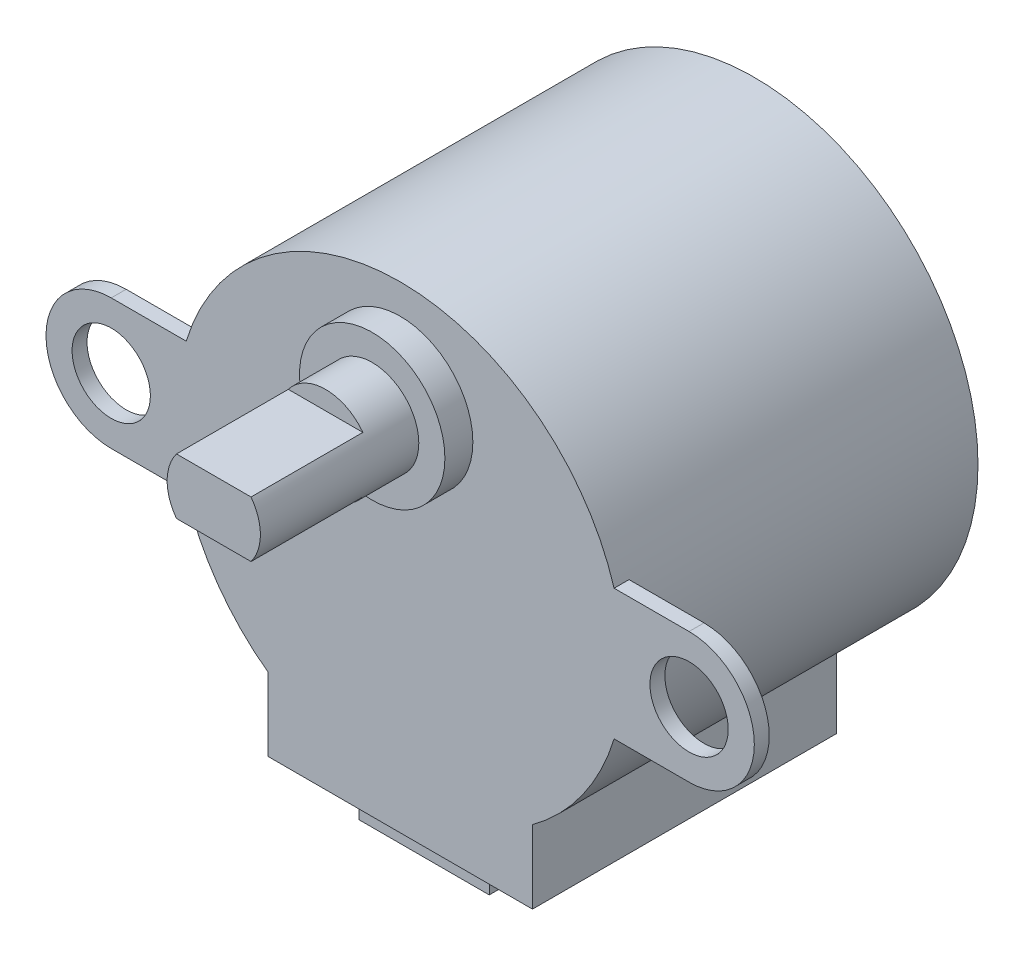
ISO-10303-21;
HEADER;
FILE_DESCRIPTION(('STEP AP214'),'2;1');
FILE_NAME('part.step','',(''),(''),'','','');
FILE_SCHEMA(('AUTOMOTIVE_DESIGN { 1 0 10303 214 1 1 1 1 }'));
ENDSEC;
DATA;
#1=APPLICATION_CONTEXT('core data for automotive mechanical design processes');
#2=APPLICATION_PROTOCOL_DEFINITION('international standard','automotive_design',2000,#1);
#3=PRODUCT_CONTEXT('',#1,'mechanical');
#4=PRODUCT('Part','Part','',(#3));
#5=PRODUCT_RELATED_PRODUCT_CATEGORY('part','',(#4));
#6=PRODUCT_DEFINITION_FORMATION('','',#4);
#7=PRODUCT_DEFINITION_CONTEXT('part definition',#1,'design');
#8=PRODUCT_DEFINITION('design','',#6,#7);
#9=PRODUCT_DEFINITION_SHAPE('','',#8);
#10=(LENGTH_UNIT() NAMED_UNIT(*) SI_UNIT(.MILLI.,.METRE.));
#11=(NAMED_UNIT(*) PLANE_ANGLE_UNIT() SI_UNIT($,.RADIAN.));
#12=(NAMED_UNIT(*) SI_UNIT($,.STERADIAN.) SOLID_ANGLE_UNIT());
#13=UNCERTAINTY_MEASURE_WITH_UNIT(LENGTH_MEASURE(1.E-05),#10,'distance_accuracy_value','');
#14=(GEOMETRIC_REPRESENTATION_CONTEXT(3) GLOBAL_UNCERTAINTY_ASSIGNED_CONTEXT((#13)) GLOBAL_UNIT_ASSIGNED_CONTEXT((#10,
#11,#12)) REPRESENTATION_CONTEXT('',''));
#15=CARTESIAN_POINT('',(0.,0.,0.));
#16=DIRECTION('',(0.,0.,1.));
#17=DIRECTION('',(1.,0.,0.));
#18=AXIS2_PLACEMENT_3D('',#15,#16,#17);
#19=CARTESIAN_POINT('',(0.,-13.6,0.));
#20=DIRECTION('',(0.,-1.,0.));
#21=DIRECTION('',(0.,0.,-1.));
#22=AXIS2_PLACEMENT_3D('',#19,#20,#21);
#23=PLANE('',#22);
#24=DIRECTION('',(0.,0.,1.));
#25=VECTOR('',#24,1.);
#26=CARTESIAN_POINT('',(-7.1,-13.6,19.));
#27=LINE('',#26,#25);
#28=CARTESIAN_POINT('',(-7.1,-13.6,2.7));
#29=VERTEX_POINT('',#28);
#30=CARTESIAN_POINT('',(-7.1,-13.6,19.));
#31=VERTEX_POINT('',#30);
#32=EDGE_CURVE('E197',#29,#31,#27,.T.);
#33=ORIENTED_EDGE('',*,*,#32,.F.);
#34=DIRECTION('',(-1.,0.,0.));
#35=VECTOR('',#34,1.);
#36=CARTESIAN_POINT('',(-7.1,-13.6,2.7));
#37=LINE('',#36,#35);
#38=CARTESIAN_POINT('',(7.1,-13.6,2.7));
#39=VERTEX_POINT('',#38);
#40=EDGE_CURVE('E209',#39,#29,#37,.T.);
#41=ORIENTED_EDGE('',*,*,#40,.F.);
#42=DIRECTION('',(0.,0.,-1.));
#43=VECTOR('',#42,1.);
#44=CARTESIAN_POINT('',(7.1,-13.6,19.));
#45=LINE('',#44,#43);
#46=CARTESIAN_POINT('',(7.1,-13.6,19.));
#47=VERTEX_POINT('',#46);
#48=EDGE_CURVE('E206',#47,#39,#45,.T.);
#49=ORIENTED_EDGE('',*,*,#48,.F.);
#50=DIRECTION('',(1.,0.,0.));
#51=VECTOR('',#50,1.);
#52=CARTESIAN_POINT('',(-7.1,-13.6,19.));
#53=LINE('',#52,#51);
#54=EDGE_CURVE('E200',#31,#47,#53,.T.);
#55=ORIENTED_EDGE('',*,*,#54,.F.);
#56=EDGE_LOOP('',(#33,#41,#49,#55));
#57=FACE_BOUND('',#56,.T.);
#58=DIRECTION('',(-1.,0.,0.));
#59=VECTOR('',#58,1.);
#60=CARTESIAN_POINT('',(-3.71951204175312,-13.6,17.5));
#61=LINE('',#60,#59);
#62=CARTESIAN_POINT('',(3.28048795824688,-13.6,17.5));
#63=VERTEX_POINT('',#62);
#64=CARTESIAN_POINT('',(-3.71951204175312,-13.6,17.5));
#65=VERTEX_POINT('',#64);
#66=EDGE_CURVE('E626',#63,#65,#61,.T.);
#67=ORIENTED_EDGE('',*,*,#66,.F.);
#68=DIRECTION('',(0.,0.,1.));
#69=VECTOR('',#68,1.);
#70=CARTESIAN_POINT('',(3.28048795824688,-13.6,16.5));
#71=LINE('',#70,#69);
#72=CARTESIAN_POINT('',(3.28048795824688,-13.6,16.5));
#73=VERTEX_POINT('',#72);
#74=EDGE_CURVE('E195',#73,#63,#71,.T.);
#75=ORIENTED_EDGE('',*,*,#74,.F.);
#76=DIRECTION('',(1.,0.,0.));
#77=VECTOR('',#76,1.);
#78=CARTESIAN_POINT('',(-3.71951204175312,-13.6,16.5));
#79=LINE('',#78,#77);
#80=CARTESIAN_POINT('',(-3.71951204175312,-13.6,16.5));
#81=VERTEX_POINT('',#80);
#82=EDGE_CURVE('E191',#81,#73,#79,.T.);
#83=ORIENTED_EDGE('',*,*,#82,.F.);
#84=DIRECTION('',(0.,0.,-1.));
#85=VECTOR('',#84,1.);
#86=CARTESIAN_POINT('',(-3.71951204175312,-13.6,16.5));
#87=LINE('',#86,#85);
#88=EDGE_CURVE('E623',#65,#81,#87,.T.);
#89=ORIENTED_EDGE('',*,*,#88,.F.);
#90=EDGE_LOOP('',(#67,#75,#83,#89));
#91=FACE_BOUND('',#90,.T.);
#92=ADVANCED_FACE('F35',(#57,#91),#23,.T.);
#93=CARTESIAN_POINT('',(0.,6.5,29.));
#94=DIRECTION('',(0.,0.,-1.));
#95=DIRECTION('',(-1.,0.,0.));
#96=AXIS2_PLACEMENT_3D('',#93,#94,#95);
#97=CYLINDRICAL_SURFACE('',#96,2.5);
#98=CARTESIAN_POINT('',(0.,6.5,20.5));
#99=DIRECTION('',(0.,0.,1.));
#100=DIRECTION('',(1.,0.,0.));
#101=AXIS2_PLACEMENT_3D('',#98,#99,#100);
#102=CIRCLE('',#101,2.5);
#103=CARTESIAN_POINT('',(2.5,6.5,20.5));
#104=VERTEX_POINT('',#103);
#105=EDGE_CURVE('E43',#104,#104,#102,.T.);
#106=ORIENTED_EDGE('',*,*,#105,.T.);
#107=EDGE_LOOP('',(#106));
#108=FACE_BOUND('',#107,.T.);
#109=DIRECTION('',(0.,0.,1.));
#110=VECTOR('',#109,1.);
#111=CARTESIAN_POINT('',(2.,8.,23.));
#112=LINE('',#111,#110);
#113=CARTESIAN_POINT('',(2.,8.,23.));
#114=VERTEX_POINT('',#113);
#115=CARTESIAN_POINT('',(2.,8.,29.));
#116=VERTEX_POINT('',#115);
#117=EDGE_CURVE('E238',#114,#116,#112,.T.);
#118=ORIENTED_EDGE('',*,*,#117,.T.);
#119=CARTESIAN_POINT('',(0.,6.5,29.));
#120=DIRECTION('',(0.,0.,1.));
#121=DIRECTION('',(1.,0.,0.));
#122=AXIS2_PLACEMENT_3D('',#119,#120,#121);
#123=CIRCLE('',#122,2.5);
#124=CARTESIAN_POINT('',(2.,5.,29.));
#125=VERTEX_POINT('',#124);
#126=EDGE_CURVE('E241',#125,#116,#123,.T.);
#127=ORIENTED_EDGE('',*,*,#126,.F.);
#128=DIRECTION('',(0.,0.,1.));
#129=VECTOR('',#128,1.);
#130=CARTESIAN_POINT('',(2.,5.,23.));
#131=LINE('',#130,#129);
#132=CARTESIAN_POINT('',(2.,5.,23.));
#133=VERTEX_POINT('',#132);
#134=EDGE_CURVE('E248',#133,#125,#131,.T.);
#135=ORIENTED_EDGE('',*,*,#134,.F.);
#136=CARTESIAN_POINT('',(0.,6.5,23.));
#137=DIRECTION('',(0.,0.,1.));
#138=DIRECTION('',(1.,0.,0.));
#139=AXIS2_PLACEMENT_3D('',#136,#137,#138);
#140=CIRCLE('',#139,2.5);
#141=CARTESIAN_POINT('',(-2.,5.,23.));
#142=VERTEX_POINT('',#141);
#143=EDGE_CURVE('E243',#142,#133,#140,.T.);
#144=ORIENTED_EDGE('',*,*,#143,.F.);
#145=DIRECTION('',(0.,0.,1.));
#146=VECTOR('',#145,1.);
#147=CARTESIAN_POINT('',(-2.,5.,23.));
#148=LINE('',#147,#146);
#149=CARTESIAN_POINT('',(-2.,5.,29.));
#150=VERTEX_POINT('',#149);
#151=EDGE_CURVE('E237',#142,#150,#148,.T.);
#152=ORIENTED_EDGE('',*,*,#151,.T.);
#153=CARTESIAN_POINT('',(-2.,8.,29.));
#154=VERTEX_POINT('',#153);
#155=EDGE_CURVE('E256',#154,#150,#123,.T.);
#156=ORIENTED_EDGE('',*,*,#155,.F.);
#157=DIRECTION('',(0.,0.,1.));
#158=VECTOR('',#157,1.);
#159=CARTESIAN_POINT('',(-2.,8.,23.));
#160=LINE('',#159,#158);
#161=CARTESIAN_POINT('',(-2.,8.,23.));
#162=VERTEX_POINT('',#161);
#163=EDGE_CURVE('E234',#162,#154,#160,.T.);
#164=ORIENTED_EDGE('',*,*,#163,.F.);
#165=CARTESIAN_POINT('',(0.,6.5,23.));
#166=DIRECTION('',(0.,0.,1.));
#167=DIRECTION('',(1.,0.,0.));
#168=AXIS2_PLACEMENT_3D('',#165,#166,#167);
#169=CIRCLE('',#168,2.5);
#170=EDGE_CURVE('E228',#114,#162,#169,.T.);
#171=ORIENTED_EDGE('',*,*,#170,.F.);
#172=EDGE_LOOP('',(#118,#127,#135,#144,#152,#156,#164,#171));
#173=FACE_BOUND('',#172,.T.);
#174=ADVANCED_FACE('F388',(#108,#173),#97,.T.);
#175=CARTESIAN_POINT('',(0.,0.,29.));
#176=DIRECTION('',(0.,0.,1.));
#177=DIRECTION('',(1.,0.,0.));
#178=AXIS2_PLACEMENT_3D('',#175,#176,#177);
#179=PLANE('',#178);
#180=ORIENTED_EDGE('',*,*,#126,.T.);
#181=DIRECTION('',(-1.,0.,0.));
#182=VECTOR('',#181,1.);
#183=CARTESIAN_POINT('',(0.,8.,29.));
#184=LINE('',#183,#182);
#185=EDGE_CURVE('E232',#116,#154,#184,.T.);
#186=ORIENTED_EDGE('',*,*,#185,.T.);
#187=ORIENTED_EDGE('',*,*,#155,.T.);
#188=DIRECTION('',(1.,0.,0.));
#189=VECTOR('',#188,1.);
#190=CARTESIAN_POINT('',(0.,5.,29.));
#191=LINE('',#190,#189);
#192=EDGE_CURVE('E227',#150,#125,#191,.T.);
#193=ORIENTED_EDGE('',*,*,#192,.T.);
#194=EDGE_LOOP('',(#180,#186,#187,#193));
#195=FACE_BOUND('',#194,.T.);
#196=ADVANCED_FACE('F394',(#195),#179,.T.);
#197=CARTESIAN_POINT('',(0.,0.,19.));
#198=DIRECTION('',(0.,0.,-1.));
#199=DIRECTION('',(-1.,0.,0.));
#200=AXIS2_PLACEMENT_3D('',#197,#198,#199);
#201=CYLINDRICAL_SURFACE('',#200,12.);
#202=CARTESIAN_POINT('',(0.,0.,2.7));
#203=DIRECTION('',(0.,0.,-1.));
#204=DIRECTION('',(-1.,0.,0.));
#205=AXIS2_PLACEMENT_3D('',#202,#203,#204);
#206=CIRCLE('',#205,12.);
#207=CARTESIAN_POINT('',(7.1,-9.67419247275968,2.7));
#208=VERTEX_POINT('',#207);
#209=CARTESIAN_POINT('',(-7.1,-9.67419247275968,2.7));
#210=VERTEX_POINT('',#209);
#211=EDGE_CURVE('E11',#208,#210,#206,.T.);
#212=ORIENTED_EDGE('',*,*,#211,.T.);
#213=DIRECTION('',(0.,0.,-1.));
#214=VECTOR('',#213,1.);
#215=CARTESIAN_POINT('',(-7.1,-9.67419247275968,19.));
#216=LINE('',#215,#214);
#217=CARTESIAN_POINT('',(-7.1,-9.67419247275968,19.));
#218=VERTEX_POINT('',#217);
#219=EDGE_CURVE('E224',#210,#218,#216,.F.);
#220=ORIENTED_EDGE('',*,*,#219,.T.);
#221=CARTESIAN_POINT('',(0.,0.,19.));
#222=DIRECTION('',(0.,0.,1.));
#223=DIRECTION('',(1.,0.,0.));
#224=AXIS2_PLACEMENT_3D('',#221,#222,#223);
#225=CIRCLE('',#224,12.);
#226=CARTESIAN_POINT('',(-11.478240283249,-3.5,19.));
#227=VERTEX_POINT('',#226);
#228=EDGE_CURVE('E331',#227,#218,#225,.T.);
#229=ORIENTED_EDGE('',*,*,#228,.F.);
#230=DIRECTION('',(0.,0.,-1.));
#231=VECTOR('',#230,1.);
#232=CARTESIAN_POINT('',(-11.478240283249,-3.5,19.));
#233=LINE('',#232,#231);
#234=CARTESIAN_POINT('',(-11.478240283249,-3.5,18.2));
#235=VERTEX_POINT('',#234);
#236=EDGE_CURVE('E311',#227,#235,#233,.T.);
#237=ORIENTED_EDGE('',*,*,#236,.T.);
#238=CARTESIAN_POINT('',(0.,0.,18.2));
#239=DIRECTION('',(0.,0.,1.));
#240=DIRECTION('',(1.,0.,0.));
#241=AXIS2_PLACEMENT_3D('',#238,#239,#240);
#242=CIRCLE('',#241,12.);
#243=CARTESIAN_POINT('',(-11.478240283249,3.5,18.2));
#244=VERTEX_POINT('',#243);
#245=EDGE_CURVE('E259',#244,#235,#242,.T.);
#246=ORIENTED_EDGE('',*,*,#245,.F.);
#247=DIRECTION('',(0.,0.,-1.));
#248=VECTOR('',#247,1.);
#249=CARTESIAN_POINT('',(-11.478240283249,3.5,19.));
#250=LINE('',#249,#248);
#251=CARTESIAN_POINT('',(-11.478240283249,3.5,19.));
#252=VERTEX_POINT('',#251);
#253=EDGE_CURVE('E314',#244,#252,#250,.F.);
#254=ORIENTED_EDGE('',*,*,#253,.T.);
#255=CARTESIAN_POINT('',(11.478240283249,3.50000000000001,19.));
#256=VERTEX_POINT('',#255);
#257=EDGE_CURVE('E327',#256,#252,#225,.T.);
#258=ORIENTED_EDGE('',*,*,#257,.F.);
#259=DIRECTION('',(0.,0.,-1.));
#260=VECTOR('',#259,1.);
#261=CARTESIAN_POINT('',(11.478240283249,3.50000000000001,19.));
#262=LINE('',#261,#260);
#263=CARTESIAN_POINT('',(11.478240283249,3.50000000000001,18.2));
#264=VERTEX_POINT('',#263);
#265=EDGE_CURVE('E317',#256,#264,#262,.T.);
#266=ORIENTED_EDGE('',*,*,#265,.T.);
#267=CARTESIAN_POINT('',(11.478240283249,-3.49999999999999,18.2));
#268=VERTEX_POINT('',#267);
#269=EDGE_CURVE('E330',#268,#264,#242,.T.);
#270=ORIENTED_EDGE('',*,*,#269,.F.);
#271=DIRECTION('',(0.,0.,-1.));
#272=VECTOR('',#271,1.);
#273=CARTESIAN_POINT('',(11.478240283249,-3.49999999999999,19.));
#274=LINE('',#273,#272);
#275=CARTESIAN_POINT('',(11.478240283249,-3.5,19.));
#276=VERTEX_POINT('',#275);
#277=EDGE_CURVE('E302',#268,#276,#274,.F.);
#278=ORIENTED_EDGE('',*,*,#277,.T.);
#279=CARTESIAN_POINT('',(7.1,-9.67419247275968,19.));
#280=VERTEX_POINT('',#279);
#281=EDGE_CURVE('E332',#280,#276,#225,.T.);
#282=ORIENTED_EDGE('',*,*,#281,.F.);
#283=DIRECTION('',(0.,0.,-1.));
#284=VECTOR('',#283,1.);
#285=CARTESIAN_POINT('',(7.1,-9.67419247275968,19.));
#286=LINE('',#285,#284);
#287=EDGE_CURVE('E216',#280,#208,#286,.T.);
#288=ORIENTED_EDGE('',*,*,#287,.T.);
#289=EDGE_LOOP('',(#212,#220,#229,#237,#246,#254,#258,#266,#270,#278,#282,#288));
#290=FACE_BOUND('',#289,.T.);
#291=CARTESIAN_POINT('',(0.,0.,0.));
#292=DIRECTION('',(0.,0.,1.));
#293=DIRECTION('',(1.,0.,0.));
#294=AXIS2_PLACEMENT_3D('',#291,#292,#293);
#295=CIRCLE('',#294,12.);
#296=CARTESIAN_POINT('',(12.,0.,0.));
#297=VERTEX_POINT('',#296);
#298=EDGE_CURVE('E324',#297,#297,#295,.T.);
#299=ORIENTED_EDGE('',*,*,#298,.T.);
#300=EDGE_LOOP('',(#299));
#301=FACE_BOUND('',#300,.T.);
#302=ADVANCED_FACE('F37',(#290,#301),#201,.T.);
#303=CARTESIAN_POINT('',(0.,0.,19.));
#304=DIRECTION('',(0.,0.,1.));
#305=DIRECTION('',(1.,0.,0.));
#306=AXIS2_PLACEMENT_3D('',#303,#304,#305);
#307=PLANE('',#306);
#308=ORIENTED_EDGE('',*,*,#228,.T.);
#309=DIRECTION('',(0.,1.,0.));
#310=VECTOR('',#309,1.);
#311=CARTESIAN_POINT('',(-7.1,-13.6,19.));
#312=LINE('',#311,#310);
#313=EDGE_CURVE('E212',#31,#218,#312,.T.);
#314=ORIENTED_EDGE('',*,*,#313,.F.);
#315=ORIENTED_EDGE('',*,*,#54,.T.);
#316=DIRECTION('',(0.,1.,0.));
#317=VECTOR('',#316,1.);
#318=CARTESIAN_POINT('',(7.1,-13.6,19.));
#319=LINE('',#318,#317);
#320=EDGE_CURVE('E58',#47,#280,#319,.T.);
#321=ORIENTED_EDGE('',*,*,#320,.T.);
#322=ORIENTED_EDGE('',*,*,#281,.T.);
#323=DIRECTION('',(1.,0.,0.));
#324=VECTOR('',#323,1.);
#325=CARTESIAN_POINT('',(-15.5,-3.5,19.));
#326=LINE('',#325,#324);
#327=CARTESIAN_POINT('',(15.5,-3.49999999999999,19.));
#328=VERTEX_POINT('',#327);
#329=EDGE_CURVE('E291',#276,#328,#326,.T.);
#330=ORIENTED_EDGE('',*,*,#329,.T.);
#331=CARTESIAN_POINT('',(15.5,0.,19.));
#332=DIRECTION('',(0.,0.,1.));
#333=DIRECTION('',(1.,0.,0.));
#334=AXIS2_PLACEMENT_3D('',#331,#332,#333);
#335=CIRCLE('',#334,3.5);
#336=CARTESIAN_POINT('',(15.5,3.50000000000001,19.));
#337=VERTEX_POINT('',#336);
#338=EDGE_CURVE('E294',#328,#337,#335,.T.);
#339=ORIENTED_EDGE('',*,*,#338,.T.);
#340=DIRECTION('',(-1.,0.,0.));
#341=VECTOR('',#340,1.);
#342=CARTESIAN_POINT('',(-15.5,3.5,19.));
#343=LINE('',#342,#341);
#344=EDGE_CURVE('E277',#337,#256,#343,.T.);
#345=ORIENTED_EDGE('',*,*,#344,.T.);
#346=ORIENTED_EDGE('',*,*,#257,.T.);
#347=CARTESIAN_POINT('',(-15.5,3.5,19.));
#348=VERTEX_POINT('',#347);
#349=EDGE_CURVE('E297',#252,#348,#343,.T.);
#350=ORIENTED_EDGE('',*,*,#349,.T.);
#351=CARTESIAN_POINT('',(-15.5,0.,19.));
#352=DIRECTION('',(0.,0.,1.));
#353=DIRECTION('',(1.,0.,0.));
#354=AXIS2_PLACEMENT_3D('',#351,#352,#353);
#355=CIRCLE('',#354,3.5);
#356=CARTESIAN_POINT('',(-15.5,-3.5,19.));
#357=VERTEX_POINT('',#356);
#358=EDGE_CURVE('E270',#348,#357,#355,.T.);
#359=ORIENTED_EDGE('',*,*,#358,.T.);
#360=EDGE_CURVE('E292',#357,#227,#326,.T.);
#361=ORIENTED_EDGE('',*,*,#360,.T.);
#362=EDGE_LOOP('',(#308,#314,#315,#321,#322,#330,#339,#345,#346,#350,#359,#361));
#363=FACE_BOUND('',#362,.T.);
#364=CARTESIAN_POINT('',(0.,6.5,19.));
#365=DIRECTION('',(0.,0.,1.));
#366=DIRECTION('',(1.,0.,0.));
#367=AXIS2_PLACEMENT_3D('',#364,#365,#366);
#368=CIRCLE('',#367,3.9);
#369=CARTESIAN_POINT('',(3.9,6.5,19.));
#370=VERTEX_POINT('',#369);
#371=EDGE_CURVE('E320',#370,#370,#368,.T.);
#372=ORIENTED_EDGE('',*,*,#371,.F.);
#373=EDGE_LOOP('',(#372));
#374=FACE_BOUND('',#373,.T.);
#375=CARTESIAN_POINT('',(15.5,0.,19.));
#376=DIRECTION('',(0.,0.,1.));
#377=DIRECTION('',(1.,0.,0.));
#378=AXIS2_PLACEMENT_3D('',#375,#376,#377);
#379=CIRCLE('',#378,2.1);
#380=CARTESIAN_POINT('',(17.6,0.,19.));
#381=VERTEX_POINT('',#380);
#382=EDGE_CURVE('E264',#381,#381,#379,.T.);
#383=ORIENTED_EDGE('',*,*,#382,.F.);
#384=EDGE_LOOP('',(#383));
#385=FACE_BOUND('',#384,.T.);
#386=CARTESIAN_POINT('',(-15.5,0.,19.));
#387=DIRECTION('',(0.,0.,1.));
#388=DIRECTION('',(1.,0.,0.));
#389=AXIS2_PLACEMENT_3D('',#386,#387,#388);
#390=CIRCLE('',#389,2.1);
#391=CARTESIAN_POINT('',(-13.4,0.,19.));
#392=VERTEX_POINT('',#391);
#393=EDGE_CURVE('E263',#392,#392,#390,.T.);
#394=ORIENTED_EDGE('',*,*,#393,.F.);
#395=EDGE_LOOP('',(#394));
#396=FACE_BOUND('',#395,.T.);
#397=ADVANCED_FACE('F354',(#363,#374,#385,#396),#307,.T.);
#398=CARTESIAN_POINT('',(0.,0.,0.));
#399=DIRECTION('',(0.,0.,1.));
#400=DIRECTION('',(1.,0.,0.));
#401=AXIS2_PLACEMENT_3D('',#398,#399,#400);
#402=PLANE('',#401);
#403=ORIENTED_EDGE('',*,*,#298,.F.);
#404=EDGE_LOOP('',(#403));
#405=FACE_BOUND('',#404,.T.);
#406=ADVANCED_FACE('F552',(#405),#402,.F.);
#407=CARTESIAN_POINT('',(0.,6.5,20.5));
#408=DIRECTION('',(0.,0.,-1.));
#409=DIRECTION('',(-1.,0.,0.));
#410=AXIS2_PLACEMENT_3D('',#407,#408,#409);
#411=CYLINDRICAL_SURFACE('',#410,3.9);
#412=CARTESIAN_POINT('',(0.,6.5,20.5));
#413=DIRECTION('',(0.,0.,1.));
#414=DIRECTION('',(1.,0.,0.));
#415=AXIS2_PLACEMENT_3D('',#412,#413,#414);
#416=CIRCLE('',#415,3.9);
#417=CARTESIAN_POINT('',(3.9,6.5,20.5));
#418=VERTEX_POINT('',#417);
#419=EDGE_CURVE('E321',#418,#418,#416,.T.);
#420=ORIENTED_EDGE('',*,*,#419,.F.);
#421=EDGE_LOOP('',(#420));
#422=FACE_BOUND('',#421,.T.);
#423=ORIENTED_EDGE('',*,*,#371,.T.);
#424=EDGE_LOOP('',(#423));
#425=FACE_BOUND('',#424,.T.);
#426=ADVANCED_FACE('F495',(#422,#425),#411,.T.);
#427=CARTESIAN_POINT('',(0.,6.5,20.5));
#428=DIRECTION('',(0.,0.,1.));
#429=DIRECTION('',(1.,0.,0.));
#430=AXIS2_PLACEMENT_3D('',#427,#428,#429);
#431=PLANE('',#430);
#432=ORIENTED_EDGE('',*,*,#105,.F.);
#433=EDGE_LOOP('',(#432));
#434=FACE_BOUND('',#433,.T.);
#435=ORIENTED_EDGE('',*,*,#419,.T.);
#436=EDGE_LOOP('',(#435));
#437=FACE_BOUND('',#436,.T.);
#438=ADVANCED_FACE('F434',(#434,#437),#431,.T.);
#439=CARTESIAN_POINT('',(15.5,0.,18.2));
#440=DIRECTION('',(0.,0.,1.));
#441=DIRECTION('',(1.,0.,0.));
#442=AXIS2_PLACEMENT_3D('',#439,#440,#441);
#443=CYLINDRICAL_SURFACE('',#442,2.1);
#444=CARTESIAN_POINT('',(15.5,0.,18.2));
#445=DIRECTION('',(0.,0.,1.));
#446=DIRECTION('',(1.,0.,0.));
#447=AXIS2_PLACEMENT_3D('',#444,#445,#446);
#448=CIRCLE('',#447,2.1);
#449=CARTESIAN_POINT('',(17.6,0.,18.2));
#450=VERTEX_POINT('',#449);
#451=EDGE_CURVE('E260',#450,#450,#448,.T.);
#452=ORIENTED_EDGE('',*,*,#451,.F.);
#453=EDGE_LOOP('',(#452));
#454=FACE_BOUND('',#453,.T.);
#455=ORIENTED_EDGE('',*,*,#382,.T.);
#456=EDGE_LOOP('',(#455));
#457=FACE_BOUND('',#456,.T.);
#458=ADVANCED_FACE('F432',(#454,#457),#443,.F.);
#459=CARTESIAN_POINT('',(15.5,0.,18.2));
#460=DIRECTION('',(0.,0.,1.));
#461=DIRECTION('',(1.,0.,0.));
#462=AXIS2_PLACEMENT_3D('',#459,#460,#461);
#463=CYLINDRICAL_SURFACE('',#462,3.5);
#464=ORIENTED_EDGE('',*,*,#338,.F.);
#465=DIRECTION('',(0.,0.,1.));
#466=VECTOR('',#465,1.);
#467=CARTESIAN_POINT('',(15.5,-3.49999999999999,18.2));
#468=LINE('',#467,#466);
#469=CARTESIAN_POINT('',(15.5,-3.49999999999999,18.2));
#470=VERTEX_POINT('',#469);
#471=EDGE_CURVE('E305',#470,#328,#468,.T.);
#472=ORIENTED_EDGE('',*,*,#471,.F.);
#473=CARTESIAN_POINT('',(15.5,0.,18.2));
#474=DIRECTION('',(0.,0.,1.));
#475=DIRECTION('',(1.,0.,0.));
#476=AXIS2_PLACEMENT_3D('',#473,#474,#475);
#477=CIRCLE('',#476,3.5);
#478=CARTESIAN_POINT('',(15.5,3.50000000000001,18.2));
#479=VERTEX_POINT('',#478);
#480=EDGE_CURVE('E281',#470,#479,#477,.T.);
#481=ORIENTED_EDGE('',*,*,#480,.T.);
#482=DIRECTION('',(0.,0.,1.));
#483=VECTOR('',#482,1.);
#484=CARTESIAN_POINT('',(15.5,3.50000000000001,18.2));
#485=LINE('',#484,#483);
#486=EDGE_CURVE('E303',#479,#337,#485,.T.);
#487=ORIENTED_EDGE('',*,*,#486,.T.);
#488=EDGE_LOOP('',(#464,#472,#481,#487));
#489=FACE_BOUND('',#488,.T.);
#490=ADVANCED_FACE('F368',(#489),#463,.T.);
#491=CARTESIAN_POINT('',(-15.5,0.,18.2));
#492=DIRECTION('',(0.,0.,1.));
#493=DIRECTION('',(1.,0.,0.));
#494=AXIS2_PLACEMENT_3D('',#491,#492,#493);
#495=PLANE('',#494);
#496=ORIENTED_EDGE('',*,*,#451,.T.);
#497=EDGE_LOOP('',(#496));
#498=FACE_BOUND('',#497,.T.);
#499=DIRECTION('',(1.,0.,0.));
#500=VECTOR('',#499,1.);
#501=CARTESIAN_POINT('',(-15.5,-3.5,18.2));
#502=LINE('',#501,#500);
#503=EDGE_CURVE('E276',#268,#470,#502,.T.);
#504=ORIENTED_EDGE('',*,*,#503,.F.);
#505=ORIENTED_EDGE('',*,*,#269,.T.);
#506=DIRECTION('',(-1.,0.,0.));
#507=VECTOR('',#506,1.);
#508=CARTESIAN_POINT('',(-15.5,3.5,18.2));
#509=LINE('',#508,#507);
#510=EDGE_CURVE('E285',#479,#264,#509,.T.);
#511=ORIENTED_EDGE('',*,*,#510,.F.);
#512=ORIENTED_EDGE('',*,*,#480,.F.);
#513=EDGE_LOOP('',(#504,#505,#511,#512));
#514=FACE_BOUND('',#513,.T.);
#515=ADVANCED_FACE('F366',(#498,#514),#495,.F.);
#516=CARTESIAN_POINT('',(-15.5,-3.5,18.2));
#517=DIRECTION('',(0.,-1.,0.));
#518=DIRECTION('',(1.,0.,0.));
#519=AXIS2_PLACEMENT_3D('',#516,#517,#518);
#520=PLANE('',#519);
#521=ORIENTED_EDGE('',*,*,#277,.F.);
#522=ORIENTED_EDGE('',*,*,#503,.T.);
#523=ORIENTED_EDGE('',*,*,#471,.T.);
#524=ORIENTED_EDGE('',*,*,#329,.F.);
#525=EDGE_LOOP('',(#521,#522,#523,#524));
#526=FACE_BOUND('',#525,.T.);
#527=ADVANCED_FACE('F357',(#526),#520,.T.);
#528=CARTESIAN_POINT('',(-15.5,3.5,18.2));
#529=DIRECTION('',(0.,1.,0.));
#530=DIRECTION('',(-1.,0.,0.));
#531=AXIS2_PLACEMENT_3D('',#528,#529,#530);
#532=PLANE('',#531);
#533=ORIENTED_EDGE('',*,*,#265,.F.);
#534=ORIENTED_EDGE('',*,*,#344,.F.);
#535=ORIENTED_EDGE('',*,*,#486,.F.);
#536=ORIENTED_EDGE('',*,*,#510,.T.);
#537=EDGE_LOOP('',(#533,#534,#535,#536));
#538=FACE_BOUND('',#537,.T.);
#539=ADVANCED_FACE('F364',(#538),#532,.T.);
#540=CARTESIAN_POINT('',(-15.5,0.,18.2));
#541=DIRECTION('',(0.,0.,1.));
#542=DIRECTION('',(1.,0.,0.));
#543=AXIS2_PLACEMENT_3D('',#540,#541,#542);
#544=CIRCLE('',#543,2.1);
#545=CARTESIAN_POINT('',(-13.4,0.,18.2));
#546=VERTEX_POINT('',#545);
#547=EDGE_CURVE('E267',#546,#546,#544,.T.);
#548=ORIENTED_EDGE('',*,*,#547,.T.);
#549=EDGE_LOOP('',(#548));
#550=FACE_BOUND('',#549,.T.);
#551=CARTESIAN_POINT('',(-15.5,3.5,18.2));
#552=VERTEX_POINT('',#551);
#553=EDGE_CURVE('E284',#244,#552,#509,.T.);
#554=ORIENTED_EDGE('',*,*,#553,.F.);
#555=ORIENTED_EDGE('',*,*,#245,.T.);
#556=CARTESIAN_POINT('',(-15.5,-3.5,18.2));
#557=VERTEX_POINT('',#556);
#558=EDGE_CURVE('E278',#557,#235,#502,.T.);
#559=ORIENTED_EDGE('',*,*,#558,.F.);
#560=CARTESIAN_POINT('',(-15.5,0.,18.2));
#561=DIRECTION('',(0.,0.,1.));
#562=DIRECTION('',(1.,0.,0.));
#563=AXIS2_PLACEMENT_3D('',#560,#561,#562);
#564=CIRCLE('',#563,3.5);
#565=EDGE_CURVE('E273',#552,#557,#564,.T.);
#566=ORIENTED_EDGE('',*,*,#565,.F.);
#567=EDGE_LOOP('',(#554,#555,#559,#566));
#568=FACE_BOUND('',#567,.T.);
#569=ADVANCED_FACE('F342',(#550,#568),#495,.F.);
#570=ORIENTED_EDGE('',*,*,#253,.F.);
#571=ORIENTED_EDGE('',*,*,#553,.T.);
#572=DIRECTION('',(0.,0.,1.));
#573=VECTOR('',#572,1.);
#574=CARTESIAN_POINT('',(-15.5,3.5,18.2));
#575=LINE('',#574,#573);
#576=EDGE_CURVE('E299',#552,#348,#575,.T.);
#577=ORIENTED_EDGE('',*,*,#576,.T.);
#578=ORIENTED_EDGE('',*,*,#349,.F.);
#579=EDGE_LOOP('',(#570,#571,#577,#578));
#580=FACE_BOUND('',#579,.T.);
#581=ADVANCED_FACE('F372',(#580),#532,.T.);
#582=ORIENTED_EDGE('',*,*,#236,.F.);
#583=ORIENTED_EDGE('',*,*,#360,.F.);
#584=DIRECTION('',(0.,0.,1.));
#585=VECTOR('',#584,1.);
#586=CARTESIAN_POINT('',(-15.5,-3.5,18.2));
#587=LINE('',#586,#585);
#588=EDGE_CURVE('E288',#557,#357,#587,.T.);
#589=ORIENTED_EDGE('',*,*,#588,.F.);
#590=ORIENTED_EDGE('',*,*,#558,.T.);
#591=EDGE_LOOP('',(#582,#583,#589,#590));
#592=FACE_BOUND('',#591,.T.);
#593=ADVANCED_FACE('F347',(#592),#520,.T.);
#594=CARTESIAN_POINT('',(-15.5,0.,18.2));
#595=DIRECTION('',(0.,0.,1.));
#596=DIRECTION('',(1.,0.,0.));
#597=AXIS2_PLACEMENT_3D('',#594,#595,#596);
#598=CYLINDRICAL_SURFACE('',#597,3.5);
#599=ORIENTED_EDGE('',*,*,#358,.F.);
#600=ORIENTED_EDGE('',*,*,#576,.F.);
#601=ORIENTED_EDGE('',*,*,#565,.T.);
#602=ORIENTED_EDGE('',*,*,#588,.T.);
#603=EDGE_LOOP('',(#599,#600,#601,#602));
#604=FACE_BOUND('',#603,.T.);
#605=ADVANCED_FACE('F374',(#604),#598,.T.);
#606=CARTESIAN_POINT('',(-15.5,0.,18.2));
#607=DIRECTION('',(0.,0.,1.));
#608=DIRECTION('',(1.,0.,0.));
#609=AXIS2_PLACEMENT_3D('',#606,#607,#608);
#610=CYLINDRICAL_SURFACE('',#609,2.1);
#611=ORIENTED_EDGE('',*,*,#547,.F.);
#612=EDGE_LOOP('',(#611));
#613=FACE_BOUND('',#612,.T.);
#614=ORIENTED_EDGE('',*,*,#393,.T.);
#615=EDGE_LOOP('',(#614));
#616=FACE_BOUND('',#615,.T.);
#617=ADVANCED_FACE('F376',(#613,#616),#610,.F.);
#618=CARTESIAN_POINT('',(0.,5.,23.));
#619=DIRECTION('',(0.,-1.,0.));
#620=DIRECTION('',(0.,0.,-1.));
#621=AXIS2_PLACEMENT_3D('',#618,#619,#620);
#622=PLANE('',#621);
#623=ORIENTED_EDGE('',*,*,#192,.F.);
#624=ORIENTED_EDGE('',*,*,#151,.F.);
#625=DIRECTION('',(1.,0.,0.));
#626=VECTOR('',#625,1.);
#627=CARTESIAN_POINT('',(0.,5.,23.));
#628=LINE('',#627,#626);
#629=EDGE_CURVE('E246',#142,#133,#628,.T.);
#630=ORIENTED_EDGE('',*,*,#629,.T.);
#631=ORIENTED_EDGE('',*,*,#134,.T.);
#632=EDGE_LOOP('',(#623,#624,#630,#631));
#633=FACE_BOUND('',#632,.T.);
#634=ADVANCED_FACE('F382',(#633),#622,.T.);
#635=CARTESIAN_POINT('',(0.,0.,23.));
#636=DIRECTION('',(0.,0.,1.));
#637=DIRECTION('',(1.,0.,0.));
#638=AXIS2_PLACEMENT_3D('',#635,#636,#637);
#639=PLANE('',#638);
#640=ORIENTED_EDGE('',*,*,#143,.T.);
#641=ORIENTED_EDGE('',*,*,#629,.F.);
#642=EDGE_LOOP('',(#640,#641));
#643=FACE_BOUND('',#642,.T.);
#644=ADVANCED_FACE('F421',(#643),#639,.T.);
#645=CARTESIAN_POINT('',(0.,8.,23.));
#646=DIRECTION('',(0.,1.,0.));
#647=DIRECTION('',(0.,0.,1.));
#648=AXIS2_PLACEMENT_3D('',#645,#646,#647);
#649=PLANE('',#648);
#650=ORIENTED_EDGE('',*,*,#185,.F.);
#651=ORIENTED_EDGE('',*,*,#117,.F.);
#652=DIRECTION('',(-1.,0.,0.));
#653=VECTOR('',#652,1.);
#654=CARTESIAN_POINT('',(0.,8.,23.));
#655=LINE('',#654,#653);
#656=EDGE_CURVE('E231',#114,#162,#655,.T.);
#657=ORIENTED_EDGE('',*,*,#656,.T.);
#658=ORIENTED_EDGE('',*,*,#163,.T.);
#659=EDGE_LOOP('',(#650,#651,#657,#658));
#660=FACE_BOUND('',#659,.T.);
#661=ADVANCED_FACE('F417',(#660),#649,.T.);
#662=CARTESIAN_POINT('',(0.,0.,23.));
#663=DIRECTION('',(0.,0.,1.));
#664=DIRECTION('',(1.,0.,0.));
#665=AXIS2_PLACEMENT_3D('',#662,#663,#664);
#666=PLANE('',#665);
#667=ORIENTED_EDGE('',*,*,#170,.T.);
#668=ORIENTED_EDGE('',*,*,#656,.F.);
#669=EDGE_LOOP('',(#667,#668));
#670=FACE_BOUND('',#669,.T.);
#671=ADVANCED_FACE('F413',(#670),#666,.T.);
#672=CARTESIAN_POINT('',(-7.1,-13.6,19.));
#673=DIRECTION('',(-1.,0.,0.));
#674=DIRECTION('',(0.,0.,1.));
#675=AXIS2_PLACEMENT_3D('',#672,#673,#674);
#676=PLANE('',#675);
#677=ORIENTED_EDGE('',*,*,#219,.F.);
#678=DIRECTION('',(0.,1.,0.));
#679=VECTOR('',#678,1.);
#680=CARTESIAN_POINT('',(-7.1,-13.6,2.7));
#681=LINE('',#680,#679);
#682=EDGE_CURVE('E213',#29,#210,#681,.T.);
#683=ORIENTED_EDGE('',*,*,#682,.F.);
#684=ORIENTED_EDGE('',*,*,#32,.T.);
#685=ORIENTED_EDGE('',*,*,#313,.T.);
#686=EDGE_LOOP('',(#677,#683,#684,#685));
#687=FACE_BOUND('',#686,.T.);
#688=ADVANCED_FACE('F409',(#687),#676,.T.);
#689=CARTESIAN_POINT('',(7.1,-13.6,19.));
#690=DIRECTION('',(1.,0.,0.));
#691=DIRECTION('',(0.,0.,-1.));
#692=AXIS2_PLACEMENT_3D('',#689,#690,#691);
#693=PLANE('',#692);
#694=ORIENTED_EDGE('',*,*,#287,.F.);
#695=ORIENTED_EDGE('',*,*,#320,.F.);
#696=ORIENTED_EDGE('',*,*,#48,.T.);
#697=DIRECTION('',(0.,1.,0.));
#698=VECTOR('',#697,1.);
#699=CARTESIAN_POINT('',(7.1,-13.6,2.7));
#700=LINE('',#699,#698);
#701=EDGE_CURVE('E217',#39,#208,#700,.T.);
#702=ORIENTED_EDGE('',*,*,#701,.T.);
#703=EDGE_LOOP('',(#694,#695,#696,#702));
#704=FACE_BOUND('',#703,.T.);
#705=ADVANCED_FACE('F405',(#704),#693,.T.);
#706=CARTESIAN_POINT('',(-7.1,-13.6,2.7));
#707=DIRECTION('',(0.,0.,-1.));
#708=DIRECTION('',(-1.,0.,0.));
#709=AXIS2_PLACEMENT_3D('',#706,#707,#708);
#710=PLANE('',#709);
#711=ORIENTED_EDGE('',*,*,#211,.F.);
#712=ORIENTED_EDGE('',*,*,#701,.F.);
#713=ORIENTED_EDGE('',*,*,#40,.T.);
#714=ORIENTED_EDGE('',*,*,#682,.T.);
#715=EDGE_LOOP('',(#711,#712,#713,#714));
#716=FACE_BOUND('',#715,.T.);
#717=ADVANCED_FACE('F402',(#716),#710,.T.);
#718=CARTESIAN_POINT('',(3.28048795824688,-15.6,16.5));
#719=DIRECTION('',(-1.,0.,0.));
#720=DIRECTION('',(0.,0.,1.));
#721=AXIS2_PLACEMENT_3D('',#718,#719,#720);
#722=PLANE('',#721);
#723=ORIENTED_EDGE('',*,*,#74,.T.);
#724=DIRECTION('',(0.,1.,0.));
#725=VECTOR('',#724,1.);
#726=CARTESIAN_POINT('',(3.28048795824688,-15.6,17.5));
#727=LINE('',#726,#725);
#728=CARTESIAN_POINT('',(3.28048795824688,-15.6,17.5));
#729=VERTEX_POINT('',#728);
#730=EDGE_CURVE('E176',#729,#63,#727,.T.);
#731=ORIENTED_EDGE('',*,*,#730,.F.);
#732=DIRECTION('',(0.,0.,1.));
#733=VECTOR('',#732,1.);
#734=CARTESIAN_POINT('',(3.28048795824688,-15.6,16.5));
#735=LINE('',#734,#733);
#736=CARTESIAN_POINT('',(3.28048795824688,-15.6,16.5));
#737=VERTEX_POINT('',#736);
#738=EDGE_CURVE('E183',#737,#729,#735,.T.);
#739=ORIENTED_EDGE('',*,*,#738,.F.);
#740=DIRECTION('',(0.,1.,0.));
#741=VECTOR('',#740,1.);
#742=CARTESIAN_POINT('',(3.28048795824688,-15.6,16.5));
#743=LINE('',#742,#741);
#744=EDGE_CURVE('E621',#737,#73,#743,.T.);
#745=ORIENTED_EDGE('',*,*,#744,.T.);
#746=EDGE_LOOP('',(#723,#731,#739,#745));
#747=FACE_BOUND('',#746,.T.);
#748=ADVANCED_FACE('F193',(#747),#722,.F.);
#749=CARTESIAN_POINT('',(-3.71951204175312,-15.6,17.5));
#750=DIRECTION('',(0.,0.,-1.));
#751=DIRECTION('',(-1.,0.,0.));
#752=AXIS2_PLACEMENT_3D('',#749,#750,#751);
#753=PLANE('',#752);
#754=ORIENTED_EDGE('',*,*,#66,.T.);
#755=DIRECTION('',(0.,1.,0.));
#756=VECTOR('',#755,1.);
#757=CARTESIAN_POINT('',(-3.71951204175312,-15.6,17.5));
#758=LINE('',#757,#756);
#759=CARTESIAN_POINT('',(-3.71951204175312,-15.6,17.5));
#760=VERTEX_POINT('',#759);
#761=EDGE_CURVE('E179',#760,#65,#758,.T.);
#762=ORIENTED_EDGE('',*,*,#761,.F.);
#763=DIRECTION('',(-1.,0.,0.));
#764=VECTOR('',#763,1.);
#765=CARTESIAN_POINT('',(-3.71951204175312,-15.6,17.5));
#766=LINE('',#765,#764);
#767=EDGE_CURVE('E172',#729,#760,#766,.T.);
#768=ORIENTED_EDGE('',*,*,#767,.F.);
#769=ORIENTED_EDGE('',*,*,#730,.T.);
#770=EDGE_LOOP('',(#754,#762,#768,#769));
#771=FACE_BOUND('',#770,.T.);
#772=ADVANCED_FACE('F174',(#771),#753,.F.);
#773=CARTESIAN_POINT('',(-3.71951204175312,-15.6,16.5));
#774=DIRECTION('',(1.,0.,0.));
#775=DIRECTION('',(0.,0.,-1.));
#776=AXIS2_PLACEMENT_3D('',#773,#774,#775);
#777=PLANE('',#776);
#778=ORIENTED_EDGE('',*,*,#88,.T.);
#779=DIRECTION('',(0.,1.,0.));
#780=VECTOR('',#779,1.);
#781=CARTESIAN_POINT('',(-3.71951204175312,-15.6,16.5));
#782=LINE('',#781,#780);
#783=CARTESIAN_POINT('',(-3.71951204175312,-15.6,16.5));
#784=VERTEX_POINT('',#783);
#785=EDGE_CURVE('E50',#784,#81,#782,.T.);
#786=ORIENTED_EDGE('',*,*,#785,.F.);
#787=DIRECTION('',(0.,0.,-1.));
#788=VECTOR('',#787,1.);
#789=CARTESIAN_POINT('',(-3.71951204175312,-15.6,16.5));
#790=LINE('',#789,#788);
#791=EDGE_CURVE('E182',#760,#784,#790,.T.);
#792=ORIENTED_EDGE('',*,*,#791,.F.);
#793=ORIENTED_EDGE('',*,*,#761,.T.);
#794=EDGE_LOOP('',(#778,#786,#792,#793));
#795=FACE_BOUND('',#794,.T.);
#796=ADVANCED_FACE('F591',(#795),#777,.F.);
#797=CARTESIAN_POINT('',(-3.71951204175312,-15.6,16.5));
#798=DIRECTION('',(0.,0.,1.));
#799=DIRECTION('',(1.,0.,0.));
#800=AXIS2_PLACEMENT_3D('',#797,#798,#799);
#801=PLANE('',#800);
#802=ORIENTED_EDGE('',*,*,#82,.T.);
#803=ORIENTED_EDGE('',*,*,#744,.F.);
#804=DIRECTION('',(1.,0.,0.));
#805=VECTOR('',#804,1.);
#806=CARTESIAN_POINT('',(-3.71951204175312,-15.6,16.5));
#807=LINE('',#806,#805);
#808=EDGE_CURVE('E187',#784,#737,#807,.T.);
#809=ORIENTED_EDGE('',*,*,#808,.F.);
#810=ORIENTED_EDGE('',*,*,#785,.T.);
#811=EDGE_LOOP('',(#802,#803,#809,#810));
#812=FACE_BOUND('',#811,.T.);
#813=ADVANCED_FACE('F599',(#812),#801,.F.);
#814=CARTESIAN_POINT('',(0.,-15.6,0.));
#815=DIRECTION('',(0.,1.,0.));
#816=DIRECTION('',(0.,0.,1.));
#817=AXIS2_PLACEMENT_3D('',#814,#815,#816);
#818=PLANE('',#817);
#819=ORIENTED_EDGE('',*,*,#738,.T.);
#820=ORIENTED_EDGE('',*,*,#767,.T.);
#821=ORIENTED_EDGE('',*,*,#791,.T.);
#822=ORIENTED_EDGE('',*,*,#808,.T.);
#823=EDGE_LOOP('',(#819,#820,#821,#822));
#824=FACE_BOUND('',#823,.T.);
#825=ADVANCED_FACE('F186',(#824),#818,.F.);
#826=CLOSED_SHELL('',(#92,#174,#196,#302,#397,#406,#426,#438,#458,#490,#515,#527,#539,#569,#581,
#593,#605,#617,#634,#644,#661,#671,#688,#705,#717,#748,#772,#796,#813,#825));
#827=MANIFOLD_SOLID_BREP('B2',#826);
#828=ADVANCED_BREP_SHAPE_REPRESENTATION('',(#18,#827),#14);
#829=SHAPE_DEFINITION_REPRESENTATION(#9,#828);
ENDSEC;
END-ISO-10303-21;
